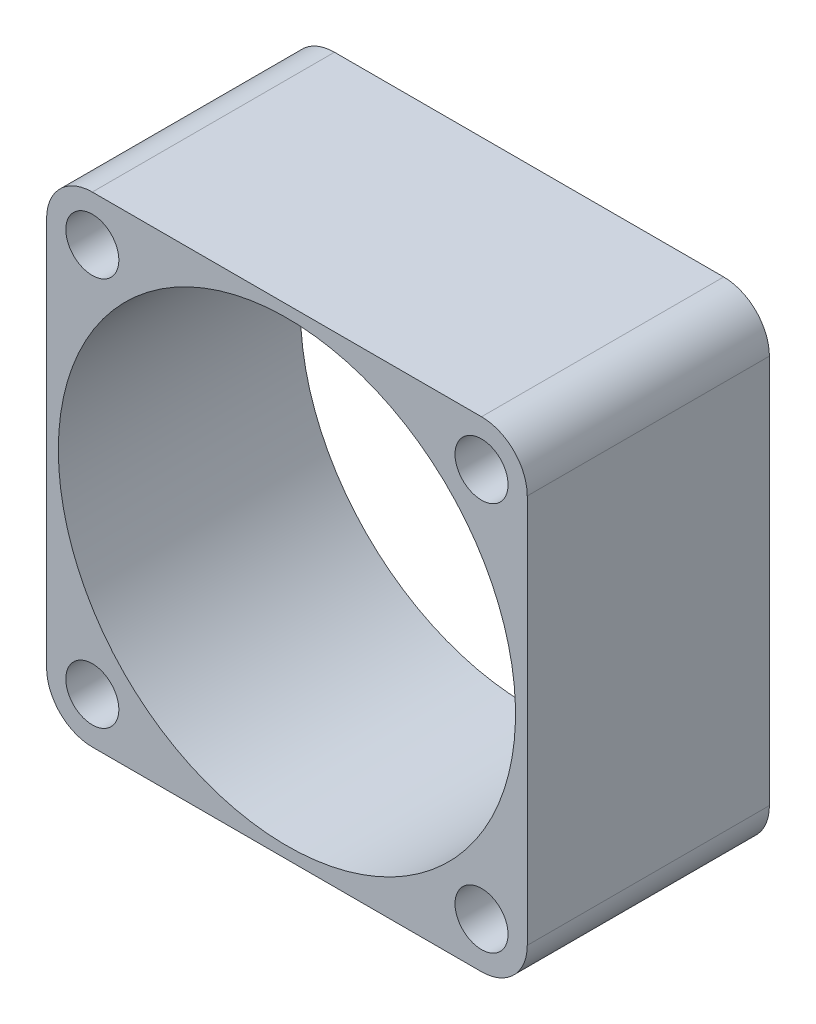
ISO-10303-21;
HEADER;
FILE_DESCRIPTION(('STEP AP214'),'2;1');
FILE_NAME('part.step','',(''),(''),'','','');
FILE_SCHEMA(('AUTOMOTIVE_DESIGN { 1 0 10303 214 1 1 1 1 }'));
ENDSEC;
DATA;
#1=APPLICATION_CONTEXT('core data for automotive mechanical design processes');
#2=APPLICATION_PROTOCOL_DEFINITION('international standard','automotive_design',2000,#1);
#3=PRODUCT_CONTEXT('',#1,'mechanical');
#4=PRODUCT('Part','Part','',(#3));
#5=PRODUCT_RELATED_PRODUCT_CATEGORY('part','',(#4));
#6=PRODUCT_DEFINITION_FORMATION('','',#4);
#7=PRODUCT_DEFINITION_CONTEXT('part definition',#1,'design');
#8=PRODUCT_DEFINITION('design','',#6,#7);
#9=PRODUCT_DEFINITION_SHAPE('','',#8);
#10=(LENGTH_UNIT() NAMED_UNIT(*) SI_UNIT(.MILLI.,.METRE.));
#11=(NAMED_UNIT(*) PLANE_ANGLE_UNIT() SI_UNIT($,.RADIAN.));
#12=(NAMED_UNIT(*) SI_UNIT($,.STERADIAN.) SOLID_ANGLE_UNIT());
#13=UNCERTAINTY_MEASURE_WITH_UNIT(LENGTH_MEASURE(1.E-05),#10,'distance_accuracy_value','');
#14=(GEOMETRIC_REPRESENTATION_CONTEXT(3) GLOBAL_UNCERTAINTY_ASSIGNED_CONTEXT((#13)) GLOBAL_UNIT_ASSIGNED_CONTEXT((#10,
#11,#12)) REPRESENTATION_CONTEXT('',''));
#15=CARTESIAN_POINT('',(0.,0.,0.));
#16=DIRECTION('',(0.,0.,1.));
#17=DIRECTION('',(1.,0.,0.));
#18=AXIS2_PLACEMENT_3D('',#15,#16,#17);
#19=CARTESIAN_POINT('',(12.03452,10.9601,49.71923));
#20=DIRECTION('',(0.,-1.,0.));
#21=DIRECTION('',(0.,0.,-1.));
#22=AXIS2_PLACEMENT_3D('',#19,#20,#21);
#23=PLANE('',#22);
#24=DIRECTION('',(-1.,0.,0.));
#25=VECTOR('',#24,1.);
#26=CARTESIAN_POINT('',(31.496,10.9601,27.5209));
#27=LINE('',#26,#25);
#28=CARTESIAN_POINT('',(47.7139,10.9601,27.5209));
#29=VERTEX_POINT('',#28);
#30=CARTESIAN_POINT('',(15.2781,10.9601,27.5209));
#31=VERTEX_POINT('',#30);
#32=EDGE_CURVE('E92',#29,#31,#27,.T.);
#33=ORIENTED_EDGE('',*,*,#32,.F.);
#34=DIRECTION('',(0.,0.,-1.));
#35=VECTOR('',#34,1.);
#36=CARTESIAN_POINT('',(47.7139,10.9601,37.61105));
#37=LINE('',#36,#35);
#38=CARTESIAN_POINT('',(47.7139,10.9601,47.7012));
#39=VERTEX_POINT('',#38);
#40=EDGE_CURVE('E104',#39,#29,#37,.T.);
#41=ORIENTED_EDGE('',*,*,#40,.F.);
#42=DIRECTION('',(1.,0.,0.));
#43=VECTOR('',#42,1.);
#44=CARTESIAN_POINT('',(31.496,10.9601,47.7012));
#45=LINE('',#44,#43);
#46=CARTESIAN_POINT('',(15.2781,10.9601,47.7012));
#47=VERTEX_POINT('',#46);
#48=EDGE_CURVE('E98',#47,#39,#45,.T.);
#49=ORIENTED_EDGE('',*,*,#48,.F.);
#50=DIRECTION('',(0.,0.,-1.));
#51=VECTOR('',#50,1.);
#52=CARTESIAN_POINT('',(15.2781,10.9601,37.61105));
#53=LINE('',#52,#51);
#54=EDGE_CURVE('E86',#47,#31,#53,.T.);
#55=ORIENTED_EDGE('',*,*,#54,.T.);
#56=EDGE_LOOP('',(#33,#41,#49,#55));
#57=FACE_BOUND('',#56,.T.);
#58=ADVANCED_FACE('F17',(#57),#23,.T.);
#59=CARTESIAN_POINT('',(47.7139,47.2059,47.7012));
#60=DIRECTION('',(0.,0.,1.));
#61=DIRECTION('',(1.,0.,0.));
#62=AXIS2_PLACEMENT_3D('',#59,#60,#61);
#63=CYLINDRICAL_SURFACE('',#62,3.8099999999999);
#64=DIRECTION('',(0.,0.,-1.));
#65=VECTOR('',#64,1.);
#66=CARTESIAN_POINT('',(47.7139,51.0159,37.61105));
#67=LINE('',#66,#65);
#68=CARTESIAN_POINT('',(47.7139,51.0159,47.7012));
#69=VERTEX_POINT('',#68);
#70=CARTESIAN_POINT('',(47.7139,51.0159,27.5209));
#71=VERTEX_POINT('',#70);
#72=EDGE_CURVE('E99',#69,#71,#67,.T.);
#73=ORIENTED_EDGE('',*,*,#72,.F.);
#74=CARTESIAN_POINT('',(47.7139,47.2059,47.7012));
#75=DIRECTION('',(0.,0.,1.));
#76=DIRECTION('',(1.,0.,0.));
#77=AXIS2_PLACEMENT_3D('',#74,#75,#76);
#78=CIRCLE('',#77,3.8099999999999);
#79=CARTESIAN_POINT('',(51.5239,47.2059,47.7012));
#80=VERTEX_POINT('',#79);
#81=EDGE_CURVE('E118',#80,#69,#78,.T.);
#82=ORIENTED_EDGE('',*,*,#81,.F.);
#83=DIRECTION('',(0.,0.,1.));
#84=VECTOR('',#83,1.);
#85=CARTESIAN_POINT('',(51.5239,47.2059,37.61105));
#86=LINE('',#85,#84);
#87=CARTESIAN_POINT('',(51.5239,47.2059,27.5209));
#88=VERTEX_POINT('',#87);
#89=EDGE_CURVE('E121',#88,#80,#86,.T.);
#90=ORIENTED_EDGE('',*,*,#89,.F.);
#91=CARTESIAN_POINT('',(47.7139,47.2059,27.5209));
#92=DIRECTION('',(0.,0.,1.));
#93=DIRECTION('',(1.,0.,0.));
#94=AXIS2_PLACEMENT_3D('',#91,#92,#93);
#95=CIRCLE('',#94,3.8099999999999);
#96=EDGE_CURVE('E172',#71,#88,#95,.F.);
#97=ORIENTED_EDGE('',*,*,#96,.F.);
#98=EDGE_LOOP('',(#73,#82,#90,#97));
#99=FACE_BOUND('',#98,.T.);
#100=ADVANCED_FACE('F189',(#99),#63,.T.);
#101=CARTESIAN_POINT('',(12.03452,51.0159,25.50287));
#102=DIRECTION('',(0.,1.,0.));
#103=DIRECTION('',(0.,0.,1.));
#104=AXIS2_PLACEMENT_3D('',#101,#102,#103);
#105=PLANE('',#104);
#106=DIRECTION('',(1.,0.,0.));
#107=VECTOR('',#106,1.);
#108=CARTESIAN_POINT('',(31.496,51.0159,27.5209));
#109=LINE('',#108,#107);
#110=CARTESIAN_POINT('',(15.2781,51.0159,27.5209));
#111=VERTEX_POINT('',#110);
#112=EDGE_CURVE('E173',#111,#71,#109,.T.);
#113=ORIENTED_EDGE('',*,*,#112,.F.);
#114=DIRECTION('',(0.,0.,-1.));
#115=VECTOR('',#114,1.);
#116=CARTESIAN_POINT('',(15.2781,51.0159,37.61105));
#117=LINE('',#116,#115);
#118=CARTESIAN_POINT('',(15.2781,51.0159,47.7012));
#119=VERTEX_POINT('',#118);
#120=EDGE_CURVE('E132',#119,#111,#117,.T.);
#121=ORIENTED_EDGE('',*,*,#120,.F.);
#122=DIRECTION('',(-1.,0.,0.));
#123=VECTOR('',#122,1.);
#124=CARTESIAN_POINT('',(31.496,51.0159,47.7012));
#125=LINE('',#124,#123);
#126=EDGE_CURVE('E115',#69,#119,#125,.T.);
#127=ORIENTED_EDGE('',*,*,#126,.F.);
#128=ORIENTED_EDGE('',*,*,#72,.T.);
#129=EDGE_LOOP('',(#113,#121,#127,#128));
#130=FACE_BOUND('',#129,.T.);
#131=ADVANCED_FACE('F186',(#130),#105,.T.);
#132=CARTESIAN_POINT('',(15.2781,47.2059,47.7012));
#133=DIRECTION('',(0.,0.,1.));
#134=DIRECTION('',(1.,0.,0.));
#135=AXIS2_PLACEMENT_3D('',#132,#133,#134);
#136=CYLINDRICAL_SURFACE('',#135,3.80999999999995);
#137=DIRECTION('',(0.,0.,-1.));
#138=VECTOR('',#137,1.);
#139=CARTESIAN_POINT('',(11.4681,47.2059,37.61105));
#140=LINE('',#139,#138);
#141=CARTESIAN_POINT('',(11.4681,47.2059,47.7012));
#142=VERTEX_POINT('',#141);
#143=CARTESIAN_POINT('',(11.4681,47.2059,27.5209));
#144=VERTEX_POINT('',#143);
#145=EDGE_CURVE('E129',#142,#144,#140,.T.);
#146=ORIENTED_EDGE('',*,*,#145,.F.);
#147=CARTESIAN_POINT('',(15.2781,47.2059,47.7012));
#148=DIRECTION('',(0.,0.,1.));
#149=DIRECTION('',(1.,0.,0.));
#150=AXIS2_PLACEMENT_3D('',#147,#148,#149);
#151=CIRCLE('',#150,3.80999999999995);
#152=EDGE_CURVE('E114',#119,#142,#151,.T.);
#153=ORIENTED_EDGE('',*,*,#152,.F.);
#154=ORIENTED_EDGE('',*,*,#120,.T.);
#155=CARTESIAN_POINT('',(15.2781,47.2059,27.5209));
#156=DIRECTION('',(0.,0.,1.));
#157=DIRECTION('',(1.,0.,0.));
#158=AXIS2_PLACEMENT_3D('',#155,#156,#157);
#159=CIRCLE('',#158,3.80999999999995);
#160=EDGE_CURVE('E174',#144,#111,#159,.F.);
#161=ORIENTED_EDGE('',*,*,#160,.F.);
#162=EDGE_LOOP('',(#146,#153,#154,#161));
#163=FACE_BOUND('',#162,.T.);
#164=ADVANCED_FACE('F181',(#163),#136,.T.);
#165=CARTESIAN_POINT('',(11.4681,11.5265200000001,25.50287));
#166=DIRECTION('',(-1.,0.,0.));
#167=DIRECTION('',(0.,0.,1.));
#168=AXIS2_PLACEMENT_3D('',#165,#166,#167);
#169=PLANE('',#168);
#170=DIRECTION('',(0.,1.,0.));
#171=VECTOR('',#170,1.);
#172=CARTESIAN_POINT('',(11.4681,30.988,27.5209));
#173=LINE('',#172,#171);
#174=CARTESIAN_POINT('',(11.4681,14.7701,27.5209));
#175=VERTEX_POINT('',#174);
#176=EDGE_CURVE('E91',#175,#144,#173,.T.);
#177=ORIENTED_EDGE('',*,*,#176,.F.);
#178=DIRECTION('',(0.,0.,-1.));
#179=VECTOR('',#178,1.);
#180=CARTESIAN_POINT('',(11.4681,14.7701,37.61105));
#181=LINE('',#180,#179);
#182=CARTESIAN_POINT('',(11.4681,14.7701,47.7012));
#183=VERTEX_POINT('',#182);
#184=EDGE_CURVE('E80',#183,#175,#181,.T.);
#185=ORIENTED_EDGE('',*,*,#184,.F.);
#186=DIRECTION('',(0.,-1.,0.));
#187=VECTOR('',#186,1.);
#188=CARTESIAN_POINT('',(11.4681,30.988,47.7012));
#189=LINE('',#188,#187);
#190=EDGE_CURVE('E110',#142,#183,#189,.T.);
#191=ORIENTED_EDGE('',*,*,#190,.F.);
#192=ORIENTED_EDGE('',*,*,#145,.T.);
#193=EDGE_LOOP('',(#177,#185,#191,#192));
#194=FACE_BOUND('',#193,.T.);
#195=ADVANCED_FACE('F178',(#194),#169,.T.);
#196=CARTESIAN_POINT('',(15.2781,14.7701,47.7012));
#197=DIRECTION('',(0.,0.,1.));
#198=DIRECTION('',(1.,0.,0.));
#199=AXIS2_PLACEMENT_3D('',#196,#197,#198);
#200=CYLINDRICAL_SURFACE('',#199,3.81);
#201=ORIENTED_EDGE('',*,*,#184,.T.);
#202=CARTESIAN_POINT('',(15.2781,14.7701,27.5209));
#203=DIRECTION('',(0.,0.,1.));
#204=DIRECTION('',(1.,0.,0.));
#205=AXIS2_PLACEMENT_3D('',#202,#203,#204);
#206=CIRCLE('',#205,3.81);
#207=EDGE_CURVE('E21',#31,#175,#206,.F.);
#208=ORIENTED_EDGE('',*,*,#207,.F.);
#209=ORIENTED_EDGE('',*,*,#54,.F.);
#210=CARTESIAN_POINT('',(15.2781,14.7701,47.7012));
#211=DIRECTION('',(0.,0.,1.));
#212=DIRECTION('',(1.,0.,0.));
#213=AXIS2_PLACEMENT_3D('',#210,#211,#212);
#214=CIRCLE('',#213,3.81);
#215=EDGE_CURVE('E113',#183,#47,#214,.T.);
#216=ORIENTED_EDGE('',*,*,#215,.F.);
#217=EDGE_LOOP('',(#201,#208,#209,#216));
#218=FACE_BOUND('',#217,.T.);
#219=ADVANCED_FACE('F85',(#218),#200,.T.);
#220=CARTESIAN_POINT('',(31.496,30.988,47.7012));
#221=DIRECTION('',(0.,0.,-1.));
#222=DIRECTION('',(-1.,0.,0.));
#223=AXIS2_PLACEMENT_3D('',#220,#221,#222);
#224=CYLINDRICAL_SURFACE('',#223,19.05);
#225=CARTESIAN_POINT('',(31.496,30.988,47.7012));
#226=DIRECTION('',(0.,0.,-1.));
#227=DIRECTION('',(-1.,0.,0.));
#228=AXIS2_PLACEMENT_3D('',#225,#226,#227);
#229=CIRCLE('',#228,19.05);
#230=CARTESIAN_POINT('',(12.446,30.988,47.7012));
#231=VERTEX_POINT('',#230);
#232=EDGE_CURVE('E150',#231,#231,#229,.T.);
#233=ORIENTED_EDGE('',*,*,#232,.F.);
#234=EDGE_LOOP('',(#233));
#235=FACE_BOUND('',#234,.T.);
#236=CARTESIAN_POINT('',(31.496,30.988,27.5209));
#237=DIRECTION('',(0.,0.,-1.));
#238=DIRECTION('',(-1.,0.,0.));
#239=AXIS2_PLACEMENT_3D('',#236,#237,#238);
#240=CIRCLE('',#239,19.05);
#241=CARTESIAN_POINT('',(12.446,30.988,27.5209));
#242=VERTEX_POINT('',#241);
#243=EDGE_CURVE('E169',#242,#242,#240,.F.);
#244=ORIENTED_EDGE('',*,*,#243,.F.);
#245=EDGE_LOOP('',(#244));
#246=FACE_BOUND('',#245,.T.);
#247=ADVANCED_FACE('F212',(#235,#246),#224,.F.);
#248=CARTESIAN_POINT('',(47.7139,47.2059,47.7012));
#249=DIRECTION('',(0.,0.,-1.));
#250=DIRECTION('',(-1.,0.,0.));
#251=AXIS2_PLACEMENT_3D('',#248,#249,#250);
#252=CYLINDRICAL_SURFACE('',#251,2.2098);
#253=CARTESIAN_POINT('',(47.7139,47.2059,47.7012));
#254=DIRECTION('',(0.,0.,-1.));
#255=DIRECTION('',(-1.,0.,0.));
#256=AXIS2_PLACEMENT_3D('',#253,#254,#255);
#257=CIRCLE('',#256,2.2098);
#258=CARTESIAN_POINT('',(45.5041,47.2059,47.7012));
#259=VERTEX_POINT('',#258);
#260=EDGE_CURVE('E147',#259,#259,#257,.T.);
#261=ORIENTED_EDGE('',*,*,#260,.F.);
#262=EDGE_LOOP('',(#261));
#263=FACE_BOUND('',#262,.T.);
#264=CARTESIAN_POINT('',(47.7139,47.2059,27.5209));
#265=DIRECTION('',(0.,0.,-1.));
#266=DIRECTION('',(-1.,0.,0.));
#267=AXIS2_PLACEMENT_3D('',#264,#265,#266);
#268=CIRCLE('',#267,2.2098);
#269=CARTESIAN_POINT('',(45.5041,47.2059,27.5209));
#270=VERTEX_POINT('',#269);
#271=EDGE_CURVE('E166',#270,#270,#268,.F.);
#272=ORIENTED_EDGE('',*,*,#271,.F.);
#273=EDGE_LOOP('',(#272));
#274=FACE_BOUND('',#273,.T.);
#275=ADVANCED_FACE('F215',(#263,#274),#252,.F.);
#276=CARTESIAN_POINT('',(15.2781,47.2059,47.7012));
#277=DIRECTION('',(0.,0.,-1.));
#278=DIRECTION('',(-1.,0.,0.));
#279=AXIS2_PLACEMENT_3D('',#276,#277,#278);
#280=CYLINDRICAL_SURFACE('',#279,2.2098);
#281=CARTESIAN_POINT('',(15.2781,47.2059,47.7012));
#282=DIRECTION('',(0.,0.,-1.));
#283=DIRECTION('',(-1.,0.,0.));
#284=AXIS2_PLACEMENT_3D('',#281,#282,#283);
#285=CIRCLE('',#284,2.2098);
#286=CARTESIAN_POINT('',(13.0683,47.2059,47.7012));
#287=VERTEX_POINT('',#286);
#288=EDGE_CURVE('E144',#287,#287,#285,.T.);
#289=ORIENTED_EDGE('',*,*,#288,.F.);
#290=EDGE_LOOP('',(#289));
#291=FACE_BOUND('',#290,.T.);
#292=CARTESIAN_POINT('',(15.2781,47.2059,27.5209));
#293=DIRECTION('',(0.,0.,-1.));
#294=DIRECTION('',(-1.,0.,0.));
#295=AXIS2_PLACEMENT_3D('',#292,#293,#294);
#296=CIRCLE('',#295,2.2098);
#297=CARTESIAN_POINT('',(13.0683,47.2059,27.5209));
#298=VERTEX_POINT('',#297);
#299=EDGE_CURVE('E163',#298,#298,#296,.F.);
#300=ORIENTED_EDGE('',*,*,#299,.F.);
#301=EDGE_LOOP('',(#300));
#302=FACE_BOUND('',#301,.T.);
#303=ADVANCED_FACE('F239',(#291,#302),#280,.F.);
#304=CARTESIAN_POINT('',(47.7139,14.7701,47.7012));
#305=DIRECTION('',(0.,0.,-1.));
#306=DIRECTION('',(-1.,0.,0.));
#307=AXIS2_PLACEMENT_3D('',#304,#305,#306);
#308=CYLINDRICAL_SURFACE('',#307,2.2098);
#309=CARTESIAN_POINT('',(47.7139,14.7701,47.7012));
#310=DIRECTION('',(0.,0.,-1.));
#311=DIRECTION('',(-1.,0.,0.));
#312=AXIS2_PLACEMENT_3D('',#309,#310,#311);
#313=CIRCLE('',#312,2.2098);
#314=CARTESIAN_POINT('',(45.5041,14.7701,47.7012));
#315=VERTEX_POINT('',#314);
#316=EDGE_CURVE('E141',#315,#315,#313,.T.);
#317=ORIENTED_EDGE('',*,*,#316,.F.);
#318=EDGE_LOOP('',(#317));
#319=FACE_BOUND('',#318,.T.);
#320=CARTESIAN_POINT('',(47.7139,14.7701,27.5209));
#321=DIRECTION('',(0.,0.,-1.));
#322=DIRECTION('',(-1.,0.,0.));
#323=AXIS2_PLACEMENT_3D('',#320,#321,#322);
#324=CIRCLE('',#323,2.2098);
#325=CARTESIAN_POINT('',(45.5041,14.7701,27.5209));
#326=VERTEX_POINT('',#325);
#327=EDGE_CURVE('E160',#326,#326,#324,.F.);
#328=ORIENTED_EDGE('',*,*,#327,.F.);
#329=EDGE_LOOP('',(#328));
#330=FACE_BOUND('',#329,.T.);
#331=ADVANCED_FACE('F226',(#319,#330),#308,.F.);
#332=CARTESIAN_POINT('',(15.2781,14.7701,47.7012));
#333=DIRECTION('',(0.,0.,-1.));
#334=DIRECTION('',(-1.,0.,0.));
#335=AXIS2_PLACEMENT_3D('',#332,#333,#334);
#336=CYLINDRICAL_SURFACE('',#335,2.2098);
#337=CARTESIAN_POINT('',(15.2781,14.7701,47.7012));
#338=DIRECTION('',(0.,0.,-1.));
#339=DIRECTION('',(-1.,0.,0.));
#340=AXIS2_PLACEMENT_3D('',#337,#338,#339);
#341=CIRCLE('',#340,2.2098);
#342=CARTESIAN_POINT('',(13.0683,14.7701,47.7012));
#343=VERTEX_POINT('',#342);
#344=EDGE_CURVE('E138',#343,#343,#341,.T.);
#345=ORIENTED_EDGE('',*,*,#344,.F.);
#346=EDGE_LOOP('',(#345));
#347=FACE_BOUND('',#346,.T.);
#348=CARTESIAN_POINT('',(15.2781,14.7701,27.5209));
#349=DIRECTION('',(0.,0.,-1.));
#350=DIRECTION('',(-1.,0.,0.));
#351=AXIS2_PLACEMENT_3D('',#348,#349,#350);
#352=CIRCLE('',#351,2.2098);
#353=CARTESIAN_POINT('',(13.0683,14.7701,27.5209));
#354=VERTEX_POINT('',#353);
#355=EDGE_CURVE('E127',#354,#354,#352,.F.);
#356=ORIENTED_EDGE('',*,*,#355,.F.);
#357=EDGE_LOOP('',(#356));
#358=FACE_BOUND('',#357,.T.);
#359=ADVANCED_FACE('F220',(#347,#358),#336,.F.);
#360=CARTESIAN_POINT('',(55.52948,6.95452,27.5209));
#361=DIRECTION('',(0.,0.,-1.));
#362=DIRECTION('',(-1.,0.,0.));
#363=AXIS2_PLACEMENT_3D('',#360,#361,#362);
#364=PLANE('',#363);
#365=ORIENTED_EDGE('',*,*,#355,.T.);
#366=EDGE_LOOP('',(#365));
#367=FACE_BOUND('',#366,.T.);
#368=ORIENTED_EDGE('',*,*,#327,.T.);
#369=EDGE_LOOP('',(#368));
#370=FACE_BOUND('',#369,.T.);
#371=ORIENTED_EDGE('',*,*,#299,.T.);
#372=EDGE_LOOP('',(#371));
#373=FACE_BOUND('',#372,.T.);
#374=ORIENTED_EDGE('',*,*,#271,.T.);
#375=EDGE_LOOP('',(#374));
#376=FACE_BOUND('',#375,.T.);
#377=ORIENTED_EDGE('',*,*,#243,.T.);
#378=EDGE_LOOP('',(#377));
#379=FACE_BOUND('',#378,.T.);
#380=CARTESIAN_POINT('',(47.7139,14.7701,27.5209));
#381=DIRECTION('',(0.,0.,1.));
#382=DIRECTION('',(1.,0.,0.));
#383=AXIS2_PLACEMENT_3D('',#380,#381,#382);
#384=CIRCLE('',#383,3.80999999999995);
#385=CARTESIAN_POINT('',(51.5239,14.7701,27.5209));
#386=VERTEX_POINT('',#385);
#387=EDGE_CURVE('E103',#29,#386,#384,.T.);
#388=ORIENTED_EDGE('',*,*,#387,.F.);
#389=ORIENTED_EDGE('',*,*,#32,.T.);
#390=ORIENTED_EDGE('',*,*,#207,.T.);
#391=ORIENTED_EDGE('',*,*,#176,.T.);
#392=ORIENTED_EDGE('',*,*,#160,.T.);
#393=ORIENTED_EDGE('',*,*,#112,.T.);
#394=ORIENTED_EDGE('',*,*,#96,.T.);
#395=DIRECTION('',(0.,1.,0.));
#396=VECTOR('',#395,1.);
#397=CARTESIAN_POINT('',(51.5239,30.988,27.5209));
#398=LINE('',#397,#396);
#399=EDGE_CURVE('E124',#386,#88,#398,.T.);
#400=ORIENTED_EDGE('',*,*,#399,.F.);
#401=EDGE_LOOP('',(#388,#389,#390,#391,#392,#393,#394,#400));
#402=FACE_BOUND('',#401,.T.);
#403=ADVANCED_FACE('F101',(#367,#370,#373,#376,#379,#402),#364,.T.);
#404=CARTESIAN_POINT('',(51.5239,11.52652,49.71923));
#405=DIRECTION('',(1.,0.,0.));
#406=DIRECTION('',(0.,0.,-1.));
#407=AXIS2_PLACEMENT_3D('',#404,#405,#406);
#408=PLANE('',#407);
#409=ORIENTED_EDGE('',*,*,#399,.T.);
#410=ORIENTED_EDGE('',*,*,#89,.T.);
#411=DIRECTION('',(0.,1.,0.));
#412=VECTOR('',#411,1.);
#413=CARTESIAN_POINT('',(51.5239,30.988,47.7012));
#414=LINE('',#413,#412);
#415=CARTESIAN_POINT('',(51.5239,14.7701,47.7012));
#416=VERTEX_POINT('',#415);
#417=EDGE_CURVE('E36',#416,#80,#414,.T.);
#418=ORIENTED_EDGE('',*,*,#417,.F.);
#419=DIRECTION('',(0.,0.,1.));
#420=VECTOR('',#419,1.);
#421=CARTESIAN_POINT('',(51.5239,14.7701,37.61105));
#422=LINE('',#421,#420);
#423=EDGE_CURVE('E27',#386,#416,#422,.T.);
#424=ORIENTED_EDGE('',*,*,#423,.F.);
#425=EDGE_LOOP('',(#409,#410,#418,#424));
#426=FACE_BOUND('',#425,.T.);
#427=ADVANCED_FACE('F190',(#426),#408,.T.);
#428=CARTESIAN_POINT('',(55.52948,55.02148,47.7012));
#429=DIRECTION('',(0.,0.,1.));
#430=DIRECTION('',(-1.,0.,0.));
#431=AXIS2_PLACEMENT_3D('',#428,#429,#430);
#432=PLANE('',#431);
#433=ORIENTED_EDGE('',*,*,#344,.T.);
#434=EDGE_LOOP('',(#433));
#435=FACE_BOUND('',#434,.T.);
#436=ORIENTED_EDGE('',*,*,#316,.T.);
#437=EDGE_LOOP('',(#436));
#438=FACE_BOUND('',#437,.T.);
#439=ORIENTED_EDGE('',*,*,#288,.T.);
#440=EDGE_LOOP('',(#439));
#441=FACE_BOUND('',#440,.T.);
#442=ORIENTED_EDGE('',*,*,#260,.T.);
#443=EDGE_LOOP('',(#442));
#444=FACE_BOUND('',#443,.T.);
#445=ORIENTED_EDGE('',*,*,#232,.T.);
#446=EDGE_LOOP('',(#445));
#447=FACE_BOUND('',#446,.T.);
#448=ORIENTED_EDGE('',*,*,#190,.T.);
#449=ORIENTED_EDGE('',*,*,#215,.T.);
#450=ORIENTED_EDGE('',*,*,#48,.T.);
#451=CARTESIAN_POINT('',(47.7139,14.7701,47.7012));
#452=DIRECTION('',(0.,0.,1.));
#453=DIRECTION('',(1.,0.,0.));
#454=AXIS2_PLACEMENT_3D('',#451,#452,#453);
#455=CIRCLE('',#454,3.80999999999995);
#456=EDGE_CURVE('E11',#416,#39,#455,.F.);
#457=ORIENTED_EDGE('',*,*,#456,.F.);
#458=ORIENTED_EDGE('',*,*,#417,.T.);
#459=ORIENTED_EDGE('',*,*,#81,.T.);
#460=ORIENTED_EDGE('',*,*,#126,.T.);
#461=ORIENTED_EDGE('',*,*,#152,.T.);
#462=EDGE_LOOP('',(#448,#449,#450,#457,#458,#459,#460,#461));
#463=FACE_BOUND('',#462,.T.);
#464=ADVANCED_FACE('F19',(#435,#438,#441,#444,#447,#463),#432,.T.);
#465=CARTESIAN_POINT('',(47.7139,14.7701,47.7012));
#466=DIRECTION('',(0.,0.,1.));
#467=DIRECTION('',(1.,0.,0.));
#468=AXIS2_PLACEMENT_3D('',#465,#466,#467);
#469=CYLINDRICAL_SURFACE('',#468,3.80999999999995);
#470=ORIENTED_EDGE('',*,*,#423,.T.);
#471=ORIENTED_EDGE('',*,*,#456,.T.);
#472=ORIENTED_EDGE('',*,*,#40,.T.);
#473=ORIENTED_EDGE('',*,*,#387,.T.);
#474=EDGE_LOOP('',(#470,#471,#472,#473));
#475=FACE_BOUND('',#474,.T.);
#476=ADVANCED_FACE('F192',(#475),#469,.T.);
#477=CLOSED_SHELL('',(#58,#100,#131,#164,#195,#219,#247,#275,#303,#331,#359,#403,#427,#464,#476));
#478=MANIFOLD_SOLID_BREP('B1',#477);
#479=ADVANCED_BREP_SHAPE_REPRESENTATION('',(#18,#478),#14);
#480=SHAPE_DEFINITION_REPRESENTATION(#9,#479);
ENDSEC;
END-ISO-10303-21;
